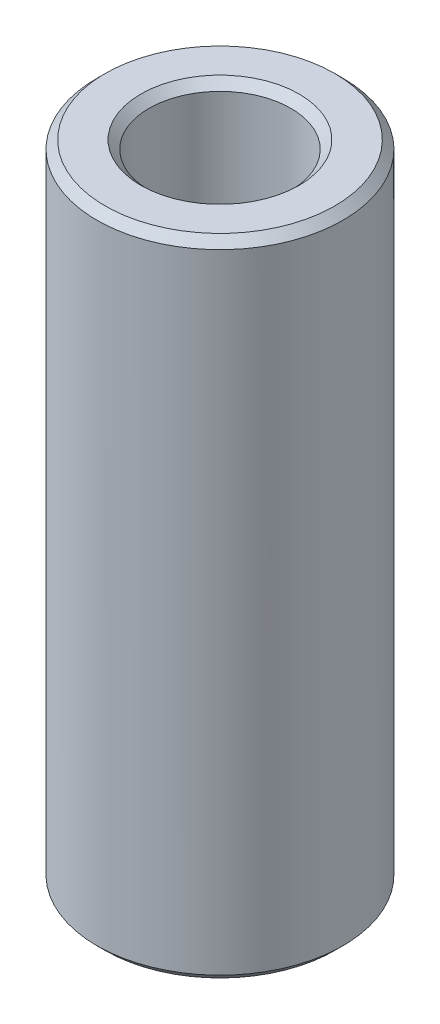
ISO-10303-21;
HEADER;
FILE_DESCRIPTION(('STEP AP214'),'2;1');
FILE_NAME('part.step','',(''),(''),'','','');
FILE_SCHEMA(('AUTOMOTIVE_DESIGN { 1 0 10303 214 1 1 1 1 }'));
ENDSEC;
DATA;
#1=APPLICATION_CONTEXT('core data for automotive mechanical design processes');
#2=APPLICATION_PROTOCOL_DEFINITION('international standard','automotive_design',2000,#1);
#3=PRODUCT_CONTEXT('',#1,'mechanical');
#4=PRODUCT('Part','Part','',(#3));
#5=PRODUCT_RELATED_PRODUCT_CATEGORY('part','',(#4));
#6=PRODUCT_DEFINITION_FORMATION('','',#4);
#7=PRODUCT_DEFINITION_CONTEXT('part definition',#1,'design');
#8=PRODUCT_DEFINITION('design','',#6,#7);
#9=PRODUCT_DEFINITION_SHAPE('','',#8);
#10=(LENGTH_UNIT() NAMED_UNIT(*) SI_UNIT(.MILLI.,.METRE.));
#11=(NAMED_UNIT(*) PLANE_ANGLE_UNIT() SI_UNIT($,.RADIAN.));
#12=(NAMED_UNIT(*) SI_UNIT($,.STERADIAN.) SOLID_ANGLE_UNIT());
#13=UNCERTAINTY_MEASURE_WITH_UNIT(LENGTH_MEASURE(1.E-05),#10,'distance_accuracy_value','');
#14=(GEOMETRIC_REPRESENTATION_CONTEXT(3) GLOBAL_UNCERTAINTY_ASSIGNED_CONTEXT((#13)) GLOBAL_UNIT_ASSIGNED_CONTEXT((#10,
#11,#12)) REPRESENTATION_CONTEXT('',''));
#15=CARTESIAN_POINT('',(0.,0.,0.));
#16=DIRECTION('',(0.,0.,1.));
#17=DIRECTION('',(1.,0.,0.));
#18=AXIS2_PLACEMENT_3D('',#15,#16,#17);
#19=CARTESIAN_POINT('',(0.,209.644705535827,0.));
#20=DIRECTION('',(0.,-1.,0.));
#21=DIRECTION('',(0.,0.,-1.));
#22=AXIS2_PLACEMENT_3D('',#19,#20,#21);
#23=CYLINDRICAL_SURFACE('',#22,40.);
#24=CARTESIAN_POINT('',(0.,2.68041506938607,0.));
#25=DIRECTION('',(0.,1.,0.));
#26=DIRECTION('',(0.,0.,1.));
#27=AXIS2_PLACEMENT_3D('',#24,#25,#26);
#28=CIRCLE('',#27,40.);
#29=CARTESIAN_POINT('',(0.,2.68041506938607,40.));
#30=VERTEX_POINT('',#29);
#31=EDGE_CURVE('E10',#30,#30,#28,.T.);
#32=ORIENTED_EDGE('',*,*,#31,.T.);
#33=EDGE_LOOP('',(#32));
#34=FACE_BOUND('',#33,.T.);
#35=CARTESIAN_POINT('',(0.,206.964290466441,0.));
#36=DIRECTION('',(0.,1.,0.));
#37=DIRECTION('',(0.,0.,1.));
#38=AXIS2_PLACEMENT_3D('',#35,#36,#37);
#39=CIRCLE('',#38,40.);
#40=CARTESIAN_POINT('',(0.,206.964290466441,-40.));
#41=VERTEX_POINT('',#40);
#42=EDGE_CURVE('E50',#41,#41,#39,.F.);
#43=ORIENTED_EDGE('',*,*,#42,.T.);
#44=EDGE_LOOP('',(#43));
#45=FACE_BOUND('',#44,.T.);
#46=ADVANCED_FACE('F39',(#34,#45),#23,.T.);
#47=CARTESIAN_POINT('',(0.,209.644705535827,0.));
#48=DIRECTION('',(0.,1.,0.));
#49=DIRECTION('',(0.,0.,1.));
#50=AXIS2_PLACEMENT_3D('',#47,#48,#49);
#51=PLANE('',#50);
#52=CARTESIAN_POINT('',(0.,209.644705535827,0.));
#53=DIRECTION('',(0.,1.,0.));
#54=DIRECTION('',(0.,0.,1.));
#55=AXIS2_PLACEMENT_3D('',#52,#53,#54);
#56=CIRCLE('',#55,25.7401121758801);
#57=CARTESIAN_POINT('',(0.,209.644705535827,25.7401121758801));
#58=VERTEX_POINT('',#57);
#59=EDGE_CURVE('E58',#58,#58,#56,.F.);
#60=ORIENTED_EDGE('',*,*,#59,.T.);
#61=EDGE_LOOP('',(#60));
#62=FACE_BOUND('',#61,.T.);
#63=CARTESIAN_POINT('',(0.,209.644705535827,0.));
#64=DIRECTION('',(0.,1.,0.));
#65=DIRECTION('',(0.,0.,1.));
#66=AXIS2_PLACEMENT_3D('',#63,#64,#65);
#67=CIRCLE('',#66,37.319584930614);
#68=CARTESIAN_POINT('',(0.,209.644705535827,-37.319584930614));
#69=VERTEX_POINT('',#68);
#70=EDGE_CURVE('E61',#69,#69,#67,.T.);
#71=ORIENTED_EDGE('',*,*,#70,.T.);
#72=EDGE_LOOP('',(#71));
#73=FACE_BOUND('',#72,.T.);
#74=ADVANCED_FACE('F88',(#62,#73),#51,.T.);
#75=CARTESIAN_POINT('',(0.,0.,0.));
#76=DIRECTION('',(0.,1.,0.));
#77=DIRECTION('',(0.,0.,1.));
#78=AXIS2_PLACEMENT_3D('',#75,#76,#77);
#79=PLANE('',#78);
#80=CARTESIAN_POINT('',(0.,0.,0.));
#81=DIRECTION('',(0.,1.,0.));
#82=DIRECTION('',(0.,0.,1.));
#83=AXIS2_PLACEMENT_3D('',#80,#81,#82);
#84=CIRCLE('',#83,25.7401121758802);
#85=CARTESIAN_POINT('',(0.,0.,25.7401121758802));
#86=VERTEX_POINT('',#85);
#87=EDGE_CURVE('E51',#86,#86,#84,.T.);
#88=ORIENTED_EDGE('',*,*,#87,.T.);
#89=EDGE_LOOP('',(#88));
#90=FACE_BOUND('',#89,.T.);
#91=CARTESIAN_POINT('',(0.,0.,0.));
#92=DIRECTION('',(0.,1.,0.));
#93=DIRECTION('',(0.,0.,1.));
#94=AXIS2_PLACEMENT_3D('',#91,#92,#93);
#95=CIRCLE('',#94,37.3195849306139);
#96=CARTESIAN_POINT('',(0.,0.,37.3195849306139));
#97=VERTEX_POINT('',#96);
#98=EDGE_CURVE('E54',#97,#97,#95,.F.);
#99=ORIENTED_EDGE('',*,*,#98,.T.);
#100=EDGE_LOOP('',(#99));
#101=FACE_BOUND('',#100,.T.);
#102=ADVANCED_FACE('F83',(#90,#101),#79,.F.);
#103=CARTESIAN_POINT('',(0.,209.644705535827,0.));
#104=DIRECTION('',(0.,-1.,0.));
#105=DIRECTION('',(0.,0.,-1.));
#106=AXIS2_PLACEMENT_3D('',#103,#104,#105);
#107=CYLINDRICAL_SURFACE('',#106,23.0596971064941);
#108=CARTESIAN_POINT('',(0.,206.964290466441,0.));
#109=DIRECTION('',(0.,1.,0.));
#110=DIRECTION('',(0.,0.,1.));
#111=AXIS2_PLACEMENT_3D('',#108,#109,#110);
#112=CIRCLE('',#111,23.0596971064941);
#113=CARTESIAN_POINT('',(0.,206.964290466441,23.0596971064941));
#114=VERTEX_POINT('',#113);
#115=EDGE_CURVE('E67',#114,#114,#112,.T.);
#116=ORIENTED_EDGE('',*,*,#115,.T.);
#117=EDGE_LOOP('',(#116));
#118=FACE_BOUND('',#117,.T.);
#119=CARTESIAN_POINT('',(0.,2.6804150693861,0.));
#120=DIRECTION('',(0.,1.,0.));
#121=DIRECTION('',(0.,0.,1.));
#122=AXIS2_PLACEMENT_3D('',#119,#120,#121);
#123=CIRCLE('',#122,23.0596971064941);
#124=CARTESIAN_POINT('',(0.,2.6804150693861,23.0596971064941));
#125=VERTEX_POINT('',#124);
#126=EDGE_CURVE('E69',#125,#125,#123,.F.);
#127=ORIENTED_EDGE('',*,*,#126,.T.);
#128=EDGE_LOOP('',(#127));
#129=FACE_BOUND('',#128,.T.);
#130=ADVANCED_FACE('F71',(#118,#129),#107,.F.);
#131=CARTESIAN_POINT('',(0.,206.964290466441,0.));
#132=DIRECTION('',(0.,1.,0.));
#133=DIRECTION('',(0.,0.,1.));
#134=AXIS2_PLACEMENT_3D('',#131,#132,#133);
#135=CONICAL_SURFACE('',#134,23.0596971064941,0.785398163397447);
#136=CARTESIAN_POINT('',(0.,209.644705535827,25.7401121758801));
#137=CARTESIAN_POINT('',(0.,209.616784545521,25.712191185574));
#138=CARTESIAN_POINT('',(0.,209.588863555215,25.6842701952679));
#139=CARTESIAN_POINT('',(0.,209.533021574602,25.6284282146557));
#140=CARTESIAN_POINT('',(0.,209.505100584296,25.6005072243496));
#141=CARTESIAN_POINT('',(0.,209.449258603684,25.5446652437374));
#142=CARTESIAN_POINT('',(0.,209.421337613378,25.5167442534312));
#143=CARTESIAN_POINT('',(0.,209.365495632766,25.460902272819));
#144=CARTESIAN_POINT('',(0.,209.33757464246,25.4329812825129));
#145=CARTESIAN_POINT('',(0.,209.281732661847,25.3771393019007));
#146=CARTESIAN_POINT('',(0.,209.253811671541,25.3492183115946));
#147=CARTESIAN_POINT('',(0.,209.197969690929,25.2933763309824));
#148=CARTESIAN_POINT('',(0.,209.170048700623,25.2654553406763));
#149=CARTESIAN_POINT('',(0.,209.114206720011,25.2096133600641));
#150=CARTESIAN_POINT('',(0.,209.086285729705,25.181692369758));
#151=CARTESIAN_POINT('',(0.,209.030443749092,25.1258503891458));
#152=CARTESIAN_POINT('',(0.,209.002522758786,25.0979293988397));
#153=CARTESIAN_POINT('',(0.,208.946680778174,25.0420874182275));
#154=CARTESIAN_POINT('',(0.,208.918759787868,25.0141664279214));
#155=CARTESIAN_POINT('',(0.,208.862917807256,24.9583244473092));
#156=CARTESIAN_POINT('',(0.,208.83499681695,24.9304034570031));
#157=CARTESIAN_POINT('',(0.,208.779154836338,24.8745614763909));
#158=CARTESIAN_POINT('',(0.,208.751233846031,24.8466404860847));
#159=CARTESIAN_POINT('',(0.,208.695391865419,24.7907985054725));
#160=CARTESIAN_POINT('',(0.,208.667470875113,24.7628775151664));
#161=CARTESIAN_POINT('',(0.,208.611628894501,24.7070355345542));
#162=CARTESIAN_POINT('',(0.,208.583707904195,24.6791145442481));
#163=CARTESIAN_POINT('',(0.,208.527865923583,24.6232725636359));
#164=CARTESIAN_POINT('',(0.,208.499944933277,24.5953515733298));
#165=CARTESIAN_POINT('',(0.,208.444102952664,24.5395095927176));
#166=CARTESIAN_POINT('',(0.,208.416181962358,24.5115886024115));
#167=CARTESIAN_POINT('',(0.,208.360339981746,24.4557466217993));
#168=CARTESIAN_POINT('',(0.,208.33241899144,24.4278256314932));
#169=CARTESIAN_POINT('',(0.,208.276577010828,24.371983650881));
#170=CARTESIAN_POINT('',(0.,208.248656020522,24.3440626605749));
#171=CARTESIAN_POINT('',(0.,208.192814039909,24.2882206799627));
#172=CARTESIAN_POINT('',(0.,208.164893049603,24.2602996896566));
#173=CARTESIAN_POINT('',(0.,208.109051068991,24.2044577090444));
#174=CARTESIAN_POINT('',(0.,208.081130078685,24.1765367187382));
#175=CARTESIAN_POINT('',(0.,208.025288098073,24.120694738126));
#176=CARTESIAN_POINT('',(0.,207.997367107767,24.0927737478199));
#177=CARTESIAN_POINT('',(0.,207.941525127154,24.0369317672077));
#178=CARTESIAN_POINT('',(0.,207.913604136848,24.0090107769016));
#179=CARTESIAN_POINT('',(0.,207.857762156236,23.9531687962894));
#180=CARTESIAN_POINT('',(0.,207.82984116593,23.9252478059833));
#181=CARTESIAN_POINT('',(0.,207.773999185318,23.8694058253711));
#182=CARTESIAN_POINT('',(0.,207.746078195012,23.841484835065));
#183=CARTESIAN_POINT('',(0.,207.690236214399,23.7856428544528));
#184=CARTESIAN_POINT('',(0.,207.662315224093,23.7577218641467));
#185=CARTESIAN_POINT('',(0.,207.606473243481,23.7018798835345));
#186=CARTESIAN_POINT('',(0.,207.578552253175,23.6739588932284));
#187=CARTESIAN_POINT('',(0.,207.522710272563,23.6181169126162));
#188=CARTESIAN_POINT('',(0.,207.494789282257,23.5901959223101));
#189=CARTESIAN_POINT('',(0.,207.438947301645,23.5343539416978));
#190=CARTESIAN_POINT('',(0.,207.411026311338,23.5064329513917));
#191=CARTESIAN_POINT('',(0.,207.355184330726,23.4505909707795));
#192=CARTESIAN_POINT('',(0.,207.32726334042,23.4226699804734));
#193=CARTESIAN_POINT('',(0.,207.271421359808,23.3668279998612));
#194=CARTESIAN_POINT('',(0.,207.243500369502,23.3389070095551));
#195=CARTESIAN_POINT('',(0.,207.18765838889,23.2830650289429));
#196=CARTESIAN_POINT('',(0.,207.159737398583,23.2551440386368));
#197=CARTESIAN_POINT('',(0.,207.103895417971,23.1993020580246));
#198=CARTESIAN_POINT('',(0.,207.075974427665,23.1713810677185));
#199=CARTESIAN_POINT('',(0.,207.020132447053,23.1155390871063));
#200=CARTESIAN_POINT('',(0.,206.992211456747,23.0876180968002));
#201=CARTESIAN_POINT('',(0.,206.964290466441,23.0596971064941));
#202=B_SPLINE_CURVE_WITH_KNOTS('',3,(#136,#137,#138,#139,#140,#141,#142,#143,#144,#145,#146,
#147,#148,#149,#150,#151,#152,#153,#154,#155,#156,#157,#158,#159,#160,#161,#162,#163,#164,#165,
#166,#167,#168,#169,#170,#171,#172,#173,#174,#175,#176,#177,#178,#179,#180,#181,#182,#183,#184,
#185,#186,#187,#188,#189,#190,#191,#192,#193,#194,#195,#196,#197,#198,#199,#200,#201),
.UNSPECIFIED.,.F.,.F.,(4,2,2,2,2,2,2,2,2,2,2,2,2,2,2,2,2,2,2,2,2,2,2,2,2,2,2,2,2,2,2,2,4),(0.,
0.118458729497355,0.23691745899469,0.355376188492025,0.47383491798938,0.592293647486718,
0.710752376984053,0.829211106481389,0.947669835978743,1.06612856547608,1.18458729497342,
1.30304602447077,1.42150475396811,1.53996348346544,1.65842221296278,1.77688094246013,
1.89533967195747,2.0137984014548,2.13225713095216,2.2507158604495,2.36917458994683,
2.48763331944417,2.60609204894152,2.72455077843886,2.84300950793619,2.96146823743355,
3.07992696693089,3.19838569642822,3.31684442592556,3.43530315542291,3.55376188492025,
3.67222061441759,3.79067934391492),.UNSPECIFIED.);
#203=EDGE_CURVE('BSEAM77',#58,#114,#202,.T.);
#204=ORIENTED_EDGE('',*,*,#59,.F.);
#205=ORIENTED_EDGE('',*,*,#115,.F.);
#206=ORIENTED_EDGE('',*,*,#203,.T.);
#207=ORIENTED_EDGE('',*,*,#203,.F.);
#208=EDGE_LOOP('',(#204,#206,#205,#207));
#209=FACE_BOUND('',#208,.T.);
#210=ADVANCED_FACE('F77',(#209),#135,.F.);
#211=CARTESIAN_POINT('',(0.,0.,0.));
#212=DIRECTION('',(0.,-1.,0.));
#213=DIRECTION('',(0.,0.,-1.));
#214=AXIS2_PLACEMENT_3D('',#211,#212,#213);
#215=CONICAL_SURFACE('',#214,25.7401121758802,0.785398163397447);
#216=ORIENTED_EDGE('',*,*,#126,.F.);
#217=EDGE_LOOP('',(#216));
#218=FACE_BOUND('',#217,.T.);
#219=ORIENTED_EDGE('',*,*,#87,.F.);
#220=EDGE_LOOP('',(#219));
#221=FACE_BOUND('',#220,.T.);
#222=ADVANCED_FACE('F73',(#218,#221),#215,.F.);
#223=CARTESIAN_POINT('',(0.,2.68041506938607,0.));
#224=DIRECTION('',(0.,1.,0.));
#225=DIRECTION('',(0.,0.,1.));
#226=AXIS2_PLACEMENT_3D('',#223,#224,#225);
#227=CONICAL_SURFACE('',#226,40.,0.785398163397447);
#228=ORIENTED_EDGE('',*,*,#98,.F.);
#229=EDGE_LOOP('',(#228));
#230=FACE_BOUND('',#229,.T.);
#231=ORIENTED_EDGE('',*,*,#31,.F.);
#232=EDGE_LOOP('',(#231));
#233=FACE_BOUND('',#232,.T.);
#234=ADVANCED_FACE('F76',(#230,#233),#227,.T.);
#235=CARTESIAN_POINT('',(0.,209.644705535827,0.));
#236=DIRECTION('',(0.,-1.,0.));
#237=DIRECTION('',(0.,0.,-1.));
#238=AXIS2_PLACEMENT_3D('',#235,#236,#237);
#239=CONICAL_SURFACE('',#238,37.319584930614,0.785398163397442);
#240=CARTESIAN_POINT('',(0.,206.964290466441,-40.));
#241=CARTESIAN_POINT('',(0.,206.992211456747,-39.9720790096939));
#242=CARTESIAN_POINT('',(0.,207.020132447053,-39.9441580193878));
#243=CARTESIAN_POINT('',(0.,207.075974427665,-39.8883160387756));
#244=CARTESIAN_POINT('',(0.,207.103895417971,-39.8603950484695));
#245=CARTESIAN_POINT('',(0.,207.159737398583,-39.8045530678573));
#246=CARTESIAN_POINT('',(0.,207.18765838889,-39.7766320775512));
#247=CARTESIAN_POINT('',(0.,207.243500369502,-39.720790096939));
#248=CARTESIAN_POINT('',(0.,207.271421359808,-39.6928691066329));
#249=CARTESIAN_POINT('',(0.,207.32726334042,-39.6370271260207));
#250=CARTESIAN_POINT('',(0.,207.355184330726,-39.6091061357146));
#251=CARTESIAN_POINT('',(0.,207.411026311338,-39.5532641551023));
#252=CARTESIAN_POINT('',(0.,207.438947301645,-39.5253431647962));
#253=CARTESIAN_POINT('',(0.,207.494789282257,-39.469501184184));
#254=CARTESIAN_POINT('',(0.,207.522710272563,-39.4415801938779));
#255=CARTESIAN_POINT('',(0.,207.578552253175,-39.3857382132657));
#256=CARTESIAN_POINT('',(0.,207.606473243481,-39.3578172229596));
#257=CARTESIAN_POINT('',(0.,207.662315224093,-39.3019752423474));
#258=CARTESIAN_POINT('',(0.,207.690236214399,-39.2740542520413));
#259=CARTESIAN_POINT('',(0.,207.746078195012,-39.2182122714291));
#260=CARTESIAN_POINT('',(0.,207.773999185318,-39.190291281123));
#261=CARTESIAN_POINT('',(0.,207.82984116593,-39.1344493005108));
#262=CARTESIAN_POINT('',(0.,207.857762156236,-39.1065283102047));
#263=CARTESIAN_POINT('',(0.,207.913604136848,-39.0506863295925));
#264=CARTESIAN_POINT('',(0.,207.941525127154,-39.0227653392864));
#265=CARTESIAN_POINT('',(0.,207.997367107767,-38.9669233586742));
#266=CARTESIAN_POINT('',(0.,208.025288098073,-38.9390023683681));
#267=CARTESIAN_POINT('',(0.,208.081130078685,-38.8831603877559));
#268=CARTESIAN_POINT('',(0.,208.109051068991,-38.8552393974497));
#269=CARTESIAN_POINT('',(0.,208.164893049603,-38.7993974168375));
#270=CARTESIAN_POINT('',(0.,208.192814039909,-38.7714764265314));
#271=CARTESIAN_POINT('',(0.,208.248656020522,-38.7156344459192));
#272=CARTESIAN_POINT('',(0.,208.276577010828,-38.6877134556131));
#273=CARTESIAN_POINT('',(0.,208.33241899144,-38.6318714750009));
#274=CARTESIAN_POINT('',(0.,208.360339981746,-38.6039504846948));
#275=CARTESIAN_POINT('',(0.,208.416181962358,-38.5481085040826));
#276=CARTESIAN_POINT('',(0.,208.444102952664,-38.5201875137765));
#277=CARTESIAN_POINT('',(0.,208.499944933276,-38.4643455331643));
#278=CARTESIAN_POINT('',(0.,208.527865923583,-38.4364245428582));
#279=CARTESIAN_POINT('',(0.,208.583707904195,-38.380582562246));
#280=CARTESIAN_POINT('',(0.,208.611628894501,-38.3526615719399));
#281=CARTESIAN_POINT('',(0.,208.667470875113,-38.2968195913277));
#282=CARTESIAN_POINT('',(0.,208.695391865419,-38.2688986010216));
#283=CARTESIAN_POINT('',(0.,208.751233846031,-38.2130566204093));
#284=CARTESIAN_POINT('',(0.,208.779154836338,-38.1851356301032));
#285=CARTESIAN_POINT('',(0.,208.83499681695,-38.129293649491));
#286=CARTESIAN_POINT('',(0.,208.862917807256,-38.1013726591849));
#287=CARTESIAN_POINT('',(0.,208.918759787868,-38.0455306785727));
#288=CARTESIAN_POINT('',(0.,208.946680778174,-38.0176096882666));
#289=CARTESIAN_POINT('',(0.,209.002522758786,-37.9617677076544));
#290=CARTESIAN_POINT('',(0.,209.030443749092,-37.9338467173483));
#291=CARTESIAN_POINT('',(0.,209.086285729705,-37.8780047367361));
#292=CARTESIAN_POINT('',(0.,209.114206720011,-37.85008374643));
#293=CARTESIAN_POINT('',(0.,209.170048700623,-37.7942417658178));
#294=CARTESIAN_POINT('',(0.,209.197969690929,-37.7663207755117));
#295=CARTESIAN_POINT('',(0.,209.253811671541,-37.7104787948995));
#296=CARTESIAN_POINT('',(0.,209.281732661847,-37.6825578045934));
#297=CARTESIAN_POINT('',(0.,209.33757464246,-37.6267158239811));
#298=CARTESIAN_POINT('',(0.,209.365495632766,-37.5987948336751));
#299=CARTESIAN_POINT('',(0.,209.421337613378,-37.5429528530628));
#300=CARTESIAN_POINT('',(0.,209.449258603684,-37.5150318627567));
#301=CARTESIAN_POINT('',(0.,209.505100584296,-37.4591898821445));
#302=CARTESIAN_POINT('',(0.,209.533021574602,-37.4312688918384));
#303=CARTESIAN_POINT('',(0.,209.588863555215,-37.3754269112262));
#304=CARTESIAN_POINT('',(0.,209.616784545521,-37.3475059209201));
#305=CARTESIAN_POINT('',(0.,209.644705535827,-37.319584930614));
#306=B_SPLINE_CURVE_WITH_KNOTS('',3,(#240,#241,#242,#243,#244,#245,#246,#247,#248,#249,#250,
#251,#252,#253,#254,#255,#256,#257,#258,#259,#260,#261,#262,#263,#264,#265,#266,#267,#268,#269,
#270,#271,#272,#273,#274,#275,#276,#277,#278,#279,#280,#281,#282,#283,#284,#285,#286,#287,#288,
#289,#290,#291,#292,#293,#294,#295,#296,#297,#298,#299,#300,#301,#302,#303,#304,#305),
.UNSPECIFIED.,.F.,.F.,(4,2,2,2,2,2,2,2,2,2,2,2,2,2,2,2,2,2,2,2,2,2,2,2,2,2,2,2,2,2,2,2,4),(0.,
0.118458729497335,0.236917458994671,0.355376188492006,0.473834917989361,0.592293647486696,
0.710752376984036,0.829211106481391,0.947669835978726,1.06612856547606,1.18458729497342,
1.30304602447075,1.42150475396809,1.53996348346544,1.65842221296278,1.77688094246011,
1.89533967195747,2.01379840145481,2.13225713095214,2.25071586044948,2.36917458994683,
2.48763331944417,2.6060920489415,2.72455077843886,2.84300950793619,2.96146823743353,
3.07992696693089,3.19838569642823,3.31684442592556,3.43530315542292,3.55376188492025,
3.67222061441759,3.79067934391494),.UNSPECIFIED.);
#307=EDGE_CURVE('BSEAM45',#41,#69,#306,.T.);
#308=ORIENTED_EDGE('',*,*,#42,.F.);
#309=ORIENTED_EDGE('',*,*,#70,.F.);
#310=ORIENTED_EDGE('',*,*,#307,.T.);
#311=ORIENTED_EDGE('',*,*,#307,.F.);
#312=EDGE_LOOP('',(#308,#310,#309,#311));
#313=FACE_BOUND('',#312,.T.);
#314=ADVANCED_FACE('F45',(#313),#239,.T.);
#315=CLOSED_SHELL('',(#46,#74,#102,#130,#210,#222,#234,#314));
#316=MANIFOLD_SOLID_BREP('B2',#315);
#317=ADVANCED_BREP_SHAPE_REPRESENTATION('',(#18,#316),#14);
#318=SHAPE_DEFINITION_REPRESENTATION(#9,#317);
ENDSEC;
END-ISO-10303-21;
